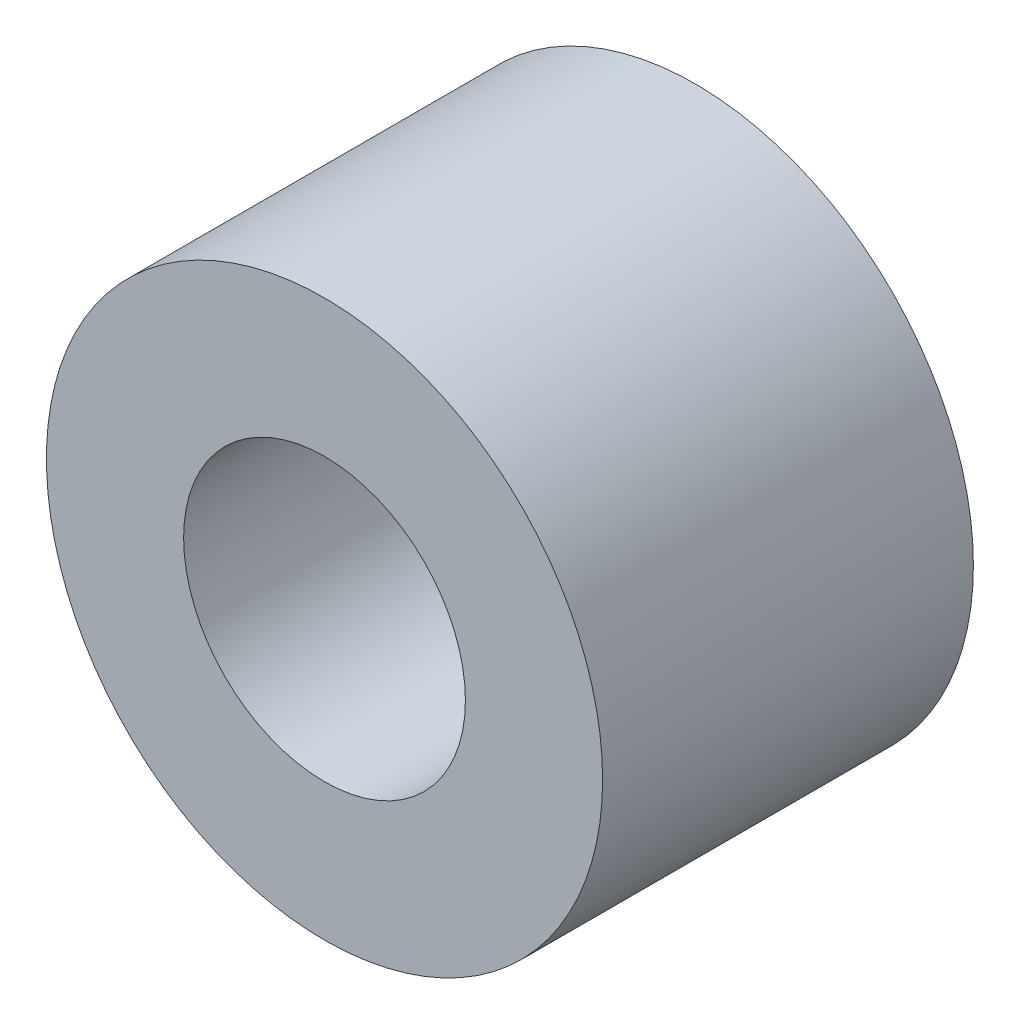
ISO-10303-21;
HEADER;
FILE_DESCRIPTION(('STEP AP214'),'2;1');
FILE_NAME('part.step','',(''),(''),'','','');
FILE_SCHEMA(('AUTOMOTIVE_DESIGN { 1 0 10303 214 1 1 1 1 }'));
ENDSEC;
DATA;
#1=APPLICATION_CONTEXT('core data for automotive mechanical design processes');
#2=APPLICATION_PROTOCOL_DEFINITION('international standard','automotive_design',2000,#1);
#3=PRODUCT_CONTEXT('',#1,'mechanical');
#4=PRODUCT('Part','Part','',(#3));
#5=PRODUCT_RELATED_PRODUCT_CATEGORY('part','',(#4));
#6=PRODUCT_DEFINITION_FORMATION('','',#4);
#7=PRODUCT_DEFINITION_CONTEXT('part definition',#1,'design');
#8=PRODUCT_DEFINITION('design','',#6,#7);
#9=PRODUCT_DEFINITION_SHAPE('','',#8);
#10=(LENGTH_UNIT() NAMED_UNIT(*) SI_UNIT(.MILLI.,.METRE.));
#11=(NAMED_UNIT(*) PLANE_ANGLE_UNIT() SI_UNIT($,.RADIAN.));
#12=(NAMED_UNIT(*) SI_UNIT($,.STERADIAN.) SOLID_ANGLE_UNIT());
#13=UNCERTAINTY_MEASURE_WITH_UNIT(LENGTH_MEASURE(1.E-05),#10,'distance_accuracy_value','');
#14=(GEOMETRIC_REPRESENTATION_CONTEXT(3) GLOBAL_UNCERTAINTY_ASSIGNED_CONTEXT((#13)) GLOBAL_UNIT_ASSIGNED_CONTEXT((#10,
#11,#12)) REPRESENTATION_CONTEXT('',''));
#15=CARTESIAN_POINT('',(0.,0.,0.));
#16=DIRECTION('',(0.,0.,1.));
#17=DIRECTION('',(1.,0.,0.));
#18=AXIS2_PLACEMENT_3D('',#15,#16,#17);
#19=CARTESIAN_POINT('',(0.,0.,6.35));
#20=DIRECTION('',(0.,0.,1.));
#21=DIRECTION('',(1.,0.,0.));
#22=AXIS2_PLACEMENT_3D('',#19,#20,#21);
#23=PLANE('',#22);
#24=CARTESIAN_POINT('',(0.,0.,6.35));
#25=DIRECTION('',(0.,0.,1.));
#26=DIRECTION('',(1.,0.,0.));
#27=AXIS2_PLACEMENT_3D('',#24,#25,#26);
#28=CIRCLE('',#27,9.525);
#29=CARTESIAN_POINT('',(9.525,0.,6.35));
#30=VERTEX_POINT('',#29);
#31=EDGE_CURVE('E10',#30,#30,#28,.T.);
#32=ORIENTED_EDGE('',*,*,#31,.T.);
#33=EDGE_LOOP('',(#32));
#34=FACE_BOUND('',#33,.T.);
#35=CARTESIAN_POINT('',(0.,0.,6.35));
#36=DIRECTION('',(0.,0.,1.));
#37=DIRECTION('',(1.,0.,0.));
#38=AXIS2_PLACEMENT_3D('',#35,#36,#37);
#39=CIRCLE('',#38,4.826);
#40=CARTESIAN_POINT('',(4.826,0.,6.35));
#41=VERTEX_POINT('',#40);
#42=EDGE_CURVE('E39',#41,#41,#39,.T.);
#43=ORIENTED_EDGE('',*,*,#42,.F.);
#44=EDGE_LOOP('',(#43));
#45=FACE_BOUND('',#44,.T.);
#46=ADVANCED_FACE('F32',(#34,#45),#23,.T.);
#47=CARTESIAN_POINT('',(0.,0.,6.35));
#48=DIRECTION('',(0.,0.,-1.));
#49=DIRECTION('',(-1.,0.,0.));
#50=AXIS2_PLACEMENT_3D('',#47,#48,#49);
#51=CYLINDRICAL_SURFACE('',#50,9.525);
#52=ORIENTED_EDGE('',*,*,#31,.F.);
#53=EDGE_LOOP('',(#52));
#54=FACE_BOUND('',#53,.T.);
#55=CARTESIAN_POINT('',(0.,0.,-6.35));
#56=DIRECTION('',(0.,0.,1.));
#57=DIRECTION('',(1.,0.,0.));
#58=AXIS2_PLACEMENT_3D('',#55,#56,#57);
#59=CIRCLE('',#58,9.525);
#60=CARTESIAN_POINT('',(9.525,0.,-6.35));
#61=VERTEX_POINT('',#60);
#62=EDGE_CURVE('E43',#61,#61,#59,.T.);
#63=ORIENTED_EDGE('',*,*,#62,.T.);
#64=EDGE_LOOP('',(#63));
#65=FACE_BOUND('',#64,.T.);
#66=ADVANCED_FACE('F34',(#54,#65),#51,.T.);
#67=CARTESIAN_POINT('',(0.,0.,6.35));
#68=DIRECTION('',(0.,0.,-1.));
#69=DIRECTION('',(-1.,0.,0.));
#70=AXIS2_PLACEMENT_3D('',#67,#68,#69);
#71=CYLINDRICAL_SURFACE('',#70,4.826);
#72=ORIENTED_EDGE('',*,*,#42,.T.);
#73=EDGE_LOOP('',(#72));
#74=FACE_BOUND('',#73,.T.);
#75=CARTESIAN_POINT('',(0.,0.,-6.35));
#76=DIRECTION('',(0.,0.,1.));
#77=DIRECTION('',(1.,0.,0.));
#78=AXIS2_PLACEMENT_3D('',#75,#76,#77);
#79=CIRCLE('',#78,4.826);
#80=CARTESIAN_POINT('',(4.826,0.,-6.35));
#81=VERTEX_POINT('',#80);
#82=EDGE_CURVE('E47',#81,#81,#79,.T.);
#83=ORIENTED_EDGE('',*,*,#82,.F.);
#84=EDGE_LOOP('',(#83));
#85=FACE_BOUND('',#84,.T.);
#86=ADVANCED_FACE('F56',(#74,#85),#71,.F.);
#87=CARTESIAN_POINT('',(0.,0.,-6.35));
#88=DIRECTION('',(0.,0.,1.));
#89=DIRECTION('',(1.,0.,0.));
#90=AXIS2_PLACEMENT_3D('',#87,#88,#89);
#91=PLANE('',#90);
#92=ORIENTED_EDGE('',*,*,#82,.T.);
#93=EDGE_LOOP('',(#92));
#94=FACE_BOUND('',#93,.T.);
#95=ORIENTED_EDGE('',*,*,#62,.F.);
#96=EDGE_LOOP('',(#95));
#97=FACE_BOUND('',#96,.T.);
#98=ADVANCED_FACE('F53',(#94,#97),#91,.F.);
#99=CLOSED_SHELL('',(#46,#66,#86,#98));
#100=MANIFOLD_SOLID_BREP('B2',#99);
#101=ADVANCED_BREP_SHAPE_REPRESENTATION('',(#18,#100),#14);
#102=SHAPE_DEFINITION_REPRESENTATION(#9,#101);
ENDSEC;
END-ISO-10303-21;
